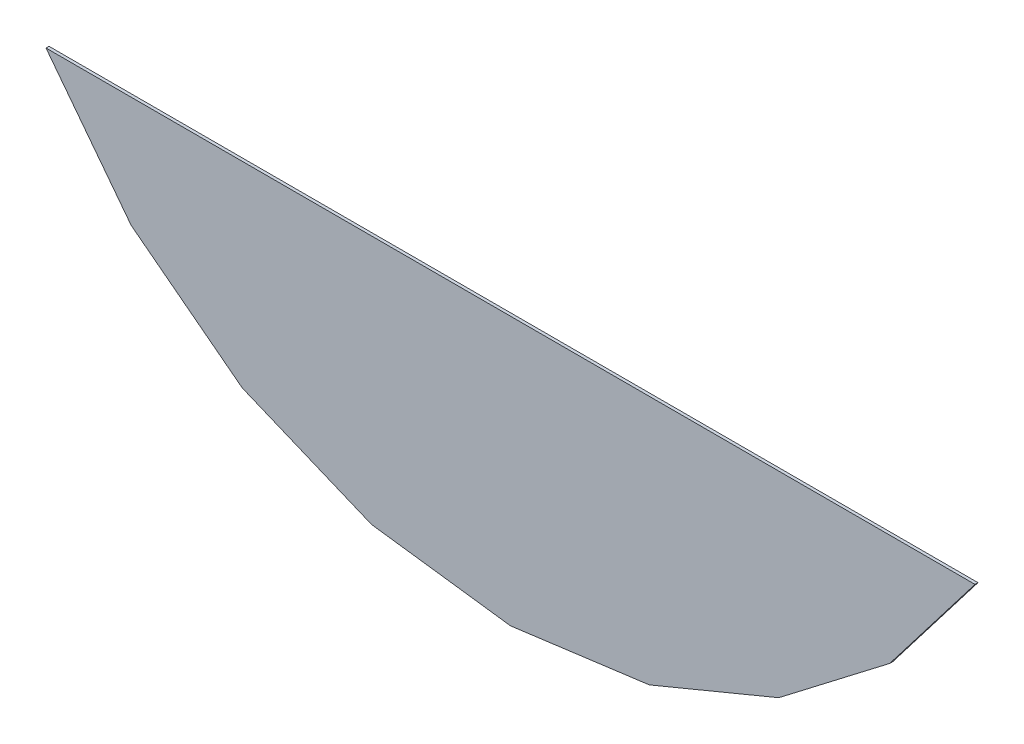
ISO-10303-21;
HEADER;
FILE_DESCRIPTION(('STEP AP214'),'2;1');
FILE_NAME('part.step','',(''),(''),'','','');
FILE_SCHEMA(('AUTOMOTIVE_DESIGN { 1 0 10303 214 1 1 1 1 }'));
ENDSEC;
DATA;
#1=APPLICATION_CONTEXT('core data for automotive mechanical design processes');
#2=APPLICATION_PROTOCOL_DEFINITION('international standard','automotive_design',2000,#1);
#3=PRODUCT_CONTEXT('',#1,'mechanical');
#4=PRODUCT('Part','Part','',(#3));
#5=PRODUCT_RELATED_PRODUCT_CATEGORY('part','',(#4));
#6=PRODUCT_DEFINITION_FORMATION('','',#4);
#7=PRODUCT_DEFINITION_CONTEXT('part definition',#1,'design');
#8=PRODUCT_DEFINITION('design','',#6,#7);
#9=PRODUCT_DEFINITION_SHAPE('','',#8);
#10=(LENGTH_UNIT() NAMED_UNIT(*) SI_UNIT(.MILLI.,.METRE.));
#11=(NAMED_UNIT(*) PLANE_ANGLE_UNIT() SI_UNIT($,.RADIAN.));
#12=(NAMED_UNIT(*) SI_UNIT($,.STERADIAN.) SOLID_ANGLE_UNIT());
#13=UNCERTAINTY_MEASURE_WITH_UNIT(LENGTH_MEASURE(1.E-05),#10,'distance_accuracy_value','');
#14=(GEOMETRIC_REPRESENTATION_CONTEXT(3) GLOBAL_UNCERTAINTY_ASSIGNED_CONTEXT((#13)) GLOBAL_UNIT_ASSIGNED_CONTEXT((#10,
#11,#12)) REPRESENTATION_CONTEXT('',''));
#15=CARTESIAN_POINT('',(0.,0.,0.));
#16=DIRECTION('',(0.,0.,1.));
#17=DIRECTION('',(1.,0.,0.));
#18=AXIS2_PLACEMENT_3D('',#15,#16,#17);
#19=CARTESIAN_POINT('',(-1.5588488,-2.74280376,3.9099998));
#20=DIRECTION('',(0.,0.,1.));
#21=DIRECTION('',(1.,0.,0.));
#22=AXIS2_PLACEMENT_3D('',#19,#20,#21);
#23=PLANE('',#22);
#24=DIRECTION('',(0.60876467009091,0.793350853310883,0.));
#25=VECTOR('',#24,1.);
#26=CARTESIAN_POINT('',(1.55884372,-2.74280376,3.9099998));
#27=LINE('',#26,#25);
#28=CARTESIAN_POINT('',(1.55884372,-2.74280376,3.9099998));
#29=VERTEX_POINT('',#28);
#30=CARTESIAN_POINT('',(1.27278891999998,-3.11559447999999,3.9099998));
#31=VERTEX_POINT('',#30);
#32=EDGE_CURVE('E126',#29,#31,#27,.F.);
#33=ORIENTED_EDGE('',*,*,#32,.F.);
#34=DIRECTION('',(1.,0.,0.));
#35=VECTOR('',#34,1.);
#36=CARTESIAN_POINT('',(-1.5588488,-2.74280376,3.9099998));
#37=LINE('',#36,#35);
#38=CARTESIAN_POINT('',(-1.55884880000003,-2.74280376000002,3.9099998));
#39=VERTEX_POINT('',#38);
#40=EDGE_CURVE('E99',#39,#29,#37,.T.);
#41=ORIENTED_EDGE('',*,*,#40,.F.);
#42=DIRECTION('',(0.60876467009091,-0.793350853310883,0.));
#43=VECTOR('',#42,1.);
#44=CARTESIAN_POINT('',(-1.272794,-3.11559448,3.9099998));
#45=LINE('',#44,#43);
#46=CARTESIAN_POINT('',(-1.27279399999999,-3.11559447999998,3.9099998));
#47=VERTEX_POINT('',#46);
#48=EDGE_CURVE('E19',#47,#39,#45,.F.);
#49=ORIENTED_EDGE('',*,*,#48,.F.);
#50=DIRECTION('',(0.793350853310883,-0.60876467009091,0.));
#51=VECTOR('',#50,1.);
#52=CARTESIAN_POINT('',(-0.90000328,-3.40164928,3.9099998));
#53=LINE('',#52,#51);
#54=CARTESIAN_POINT('',(-0.900003280000004,-3.40164928000001,3.9099998));
#55=VERTEX_POINT('',#54);
#56=EDGE_CURVE('E88',#55,#47,#53,.F.);
#57=ORIENTED_EDGE('',*,*,#56,.F.);
#58=DIRECTION('',(0.923880918501279,-0.382680086272115,0.));
#59=VECTOR('',#58,1.);
#60=CARTESIAN_POINT('',(-0.46587664,-3.58146858,3.9099998));
#61=LINE('',#60,#59);
#62=CARTESIAN_POINT('',(-0.465876640000006,-3.58146858000004,3.9099998));
#63=VERTEX_POINT('',#62);
#64=EDGE_CURVE('E83',#63,#55,#61,.F.);
#65=ORIENTED_EDGE('',*,*,#64,.F.);
#66=DIRECTION('',(0.991444891344749,-0.130525964567967,0.));
#67=VECTOR('',#66,1.);
#68=CARTESIAN_POINT('',(-2.539999996998E-06,-3.64280196,3.9099998));
#69=LINE('',#68,#67);
#70=CARTESIAN_POINT('',(-2.54000000317963E-06,-3.64280195999996,3.9099998));
#71=VERTEX_POINT('',#70);
#72=EDGE_CURVE('E110',#71,#63,#69,.F.);
#73=ORIENTED_EDGE('',*,*,#72,.F.);
#74=DIRECTION('',(0.991444891344749,0.130525964567967,0.));
#75=VECTOR('',#74,1.);
#76=CARTESIAN_POINT('',(0.46587156,-3.58146858,3.9099998));
#77=LINE('',#76,#75);
#78=CARTESIAN_POINT('',(0.465871559999998,-3.58146857999999,3.9099998));
#79=VERTEX_POINT('',#78);
#80=EDGE_CURVE('E114',#79,#71,#77,.F.);
#81=ORIENTED_EDGE('',*,*,#80,.F.);
#82=DIRECTION('',(0.923880918501279,0.382680086272115,0.));
#83=VECTOR('',#82,1.);
#84=CARTESIAN_POINT('',(0.8999982,-3.40164928,3.9099998));
#85=LINE('',#84,#83);
#86=CARTESIAN_POINT('',(0.899998200000011,-3.40164928000002,3.9099998));
#87=VERTEX_POINT('',#86);
#88=EDGE_CURVE('E118',#87,#79,#85,.F.);
#89=ORIENTED_EDGE('',*,*,#88,.F.);
#90=DIRECTION('',(0.793350853310883,0.60876467009091,0.));
#91=VECTOR('',#90,1.);
#92=CARTESIAN_POINT('',(1.27278892,-3.11559448,3.9099998));
#93=LINE('',#92,#91);
#94=EDGE_CURVE('E122',#31,#87,#93,.F.);
#95=ORIENTED_EDGE('',*,*,#94,.F.);
#96=EDGE_LOOP('',(#33,#41,#49,#57,#65,#73,#81,#89,#95));
#97=FACE_BOUND('',#96,.T.);
#98=ADVANCED_FACE('F16',(#97),#23,.T.);
#99=CARTESIAN_POINT('',(-1.272794,-3.11559448,3.89999982));
#100=DIRECTION('',(-0.793350853310883,-0.60876467009091,0.));
#101=DIRECTION('',(0.60876467009091,-0.793350853310883,0.));
#102=AXIS2_PLACEMENT_3D('',#99,#100,#101);
#103=PLANE('',#102);
#104=DIRECTION('',(0.,0.,1.));
#105=VECTOR('',#104,1.);
#106=CARTESIAN_POINT('',(-1.5588488,-2.74280376,3.89999982));
#107=LINE('',#106,#105);
#108=CARTESIAN_POINT('',(-1.55884880000003,-2.74280376000002,3.89999982));
#109=VERTEX_POINT('',#108);
#110=EDGE_CURVE('E130',#109,#39,#107,.T.);
#111=ORIENTED_EDGE('',*,*,#110,.F.);
#112=DIRECTION('',(0.608764670090777,-0.793350853310985,0.));
#113=VECTOR('',#112,1.);
#114=CARTESIAN_POINT('',(-1.5588488,-2.74280376,3.89999982));
#115=LINE('',#114,#113);
#116=CARTESIAN_POINT('',(-1.27279399999999,-3.11559447999998,3.89999982));
#117=VERTEX_POINT('',#116);
#118=EDGE_CURVE('E105',#109,#117,#115,.T.);
#119=ORIENTED_EDGE('',*,*,#118,.T.);
#120=DIRECTION('',(0.,0.,1.));
#121=VECTOR('',#120,1.);
#122=CARTESIAN_POINT('',(-1.27279399999995,-3.11559447999994,3.89999982));
#123=LINE('',#122,#121);
#124=EDGE_CURVE('E93',#47,#117,#123,.F.);
#125=ORIENTED_EDGE('',*,*,#124,.F.);
#126=ORIENTED_EDGE('',*,*,#48,.T.);
#127=EDGE_LOOP('',(#111,#119,#125,#126));
#128=FACE_BOUND('',#127,.T.);
#129=ADVANCED_FACE('F104',(#128),#103,.T.);
#130=CARTESIAN_POINT('',(-0.90000328,-3.40164928,3.89999982));
#131=DIRECTION('',(-0.60876467009091,-0.793350853310883,0.));
#132=DIRECTION('',(0.793350853310883,-0.60876467009091,0.));
#133=AXIS2_PLACEMENT_3D('',#130,#131,#132);
#134=PLANE('',#133);
#135=ORIENTED_EDGE('',*,*,#124,.T.);
#136=DIRECTION('',(0.793350853310985,-0.608764670090777,0.));
#137=VECTOR('',#136,1.);
#138=CARTESIAN_POINT('',(-1.272794,-3.11559448,3.89999982));
#139=LINE('',#138,#137);
#140=CARTESIAN_POINT('',(-0.900003280000004,-3.40164928000001,3.89999982));
#141=VERTEX_POINT('',#140);
#142=EDGE_CURVE('E135',#117,#141,#139,.T.);
#143=ORIENTED_EDGE('',*,*,#142,.T.);
#144=DIRECTION('',(0.,0.,1.));
#145=VECTOR('',#144,1.);
#146=CARTESIAN_POINT('',(-0.900003280000013,-3.40164928000003,3.89999982));
#147=LINE('',#146,#145);
#148=EDGE_CURVE('E95',#55,#141,#147,.F.);
#149=ORIENTED_EDGE('',*,*,#148,.F.);
#150=ORIENTED_EDGE('',*,*,#56,.T.);
#151=EDGE_LOOP('',(#135,#143,#149,#150));
#152=FACE_BOUND('',#151,.T.);
#153=ADVANCED_FACE('F90',(#152),#134,.T.);
#154=CARTESIAN_POINT('',(-0.46587664,-3.58146858,3.89999982));
#155=DIRECTION('',(-0.382680086272115,-0.923880918501279,0.));
#156=DIRECTION('',(0.923880918501279,-0.382680086272115,0.));
#157=AXIS2_PLACEMENT_3D('',#154,#155,#156);
#158=PLANE('',#157);
#159=ORIENTED_EDGE('',*,*,#148,.T.);
#160=DIRECTION('',(0.923880918501252,-0.382680086272181,0.));
#161=VECTOR('',#160,1.);
#162=CARTESIAN_POINT('',(-0.90000328,-3.40164928,3.89999982));
#163=LINE('',#162,#161);
#164=CARTESIAN_POINT('',(-0.465876640000006,-3.58146858000004,3.89999982));
#165=VERTEX_POINT('',#164);
#166=EDGE_CURVE('E137',#141,#165,#163,.T.);
#167=ORIENTED_EDGE('',*,*,#166,.T.);
#168=DIRECTION('',(0.,0.,1.));
#169=VECTOR('',#168,1.);
#170=CARTESIAN_POINT('',(-0.465876640000022,-3.58146858000017,3.89999982));
#171=LINE('',#170,#169);
#172=EDGE_CURVE('E112',#63,#165,#171,.F.);
#173=ORIENTED_EDGE('',*,*,#172,.F.);
#174=ORIENTED_EDGE('',*,*,#64,.T.);
#175=EDGE_LOOP('',(#159,#167,#173,#174));
#176=FACE_BOUND('',#175,.T.);
#177=ADVANCED_FACE('F179',(#176),#158,.T.);
#178=CARTESIAN_POINT('',(-2.539999996998E-06,-3.64280196,3.89999982));
#179=DIRECTION('',(-0.130525964567967,-0.991444891344749,0.));
#180=DIRECTION('',(0.991444891344749,-0.130525964567967,0.));
#181=AXIS2_PLACEMENT_3D('',#178,#179,#180);
#182=PLANE('',#181);
#183=ORIENTED_EDGE('',*,*,#172,.T.);
#184=DIRECTION('',(0.991444891344702,-0.13052596456833,0.));
#185=VECTOR('',#184,1.);
#186=CARTESIAN_POINT('',(-0.46587664,-3.58146858,3.89999982));
#187=LINE('',#186,#185);
#188=CARTESIAN_POINT('',(-2.54000000290879E-06,-3.64280195999996,3.89999982));
#189=VERTEX_POINT('',#188);
#190=EDGE_CURVE('E140',#165,#189,#187,.T.);
#191=ORIENTED_EDGE('',*,*,#190,.T.);
#192=DIRECTION('',(0.,0.,1.));
#193=VECTOR('',#192,1.);
#194=CARTESIAN_POINT('',(-2.5400000195578E-06,-3.64280195999983,3.89999982));
#195=LINE('',#194,#193);
#196=EDGE_CURVE('E116',#71,#189,#195,.F.);
#197=ORIENTED_EDGE('',*,*,#196,.F.);
#198=ORIENTED_EDGE('',*,*,#72,.T.);
#199=EDGE_LOOP('',(#183,#191,#197,#198));
#200=FACE_BOUND('',#199,.T.);
#201=ADVANCED_FACE('F177',(#200),#182,.T.);
#202=CARTESIAN_POINT('',(0.46587156,-3.58146858,3.89999982));
#203=DIRECTION('',(0.130525964567967,-0.991444891344749,0.));
#204=DIRECTION('',(0.991444891344749,0.130525964567967,0.));
#205=AXIS2_PLACEMENT_3D('',#202,#203,#204);
#206=PLANE('',#205);
#207=ORIENTED_EDGE('',*,*,#196,.T.);
#208=DIRECTION('',(0.991444891344701,0.130525964568331,0.));
#209=VECTOR('',#208,1.);
#210=CARTESIAN_POINT('',(-2.5399999970064E-06,-3.64280196,3.89999982));
#211=LINE('',#210,#209);
#212=CARTESIAN_POINT('',(0.465871559999997,-3.58146857999999,3.89999982));
#213=VERTEX_POINT('',#212);
#214=EDGE_CURVE('E143',#189,#213,#211,.T.);
#215=ORIENTED_EDGE('',*,*,#214,.T.);
#216=DIRECTION('',(0.,0.,1.));
#217=VECTOR('',#216,1.);
#218=CARTESIAN_POINT('',(0.465871559999987,-3.58146857999997,3.89999982));
#219=LINE('',#218,#217);
#220=EDGE_CURVE('E120',#79,#213,#219,.F.);
#221=ORIENTED_EDGE('',*,*,#220,.F.);
#222=ORIENTED_EDGE('',*,*,#80,.T.);
#223=EDGE_LOOP('',(#207,#215,#221,#222));
#224=FACE_BOUND('',#223,.T.);
#225=ADVANCED_FACE('F173',(#224),#206,.T.);
#226=CARTESIAN_POINT('',(0.8999982,-3.40164928,3.89999982));
#227=DIRECTION('',(0.382680086272115,-0.923880918501279,0.));
#228=DIRECTION('',(0.923880918501279,0.382680086272115,0.));
#229=AXIS2_PLACEMENT_3D('',#226,#227,#228);
#230=PLANE('',#229);
#231=ORIENTED_EDGE('',*,*,#220,.T.);
#232=DIRECTION('',(0.923880918501251,0.382680086272181,0.));
#233=VECTOR('',#232,1.);
#234=CARTESIAN_POINT('',(0.46587156,-3.58146858,3.89999982));
#235=LINE('',#234,#233);
#236=CARTESIAN_POINT('',(0.899998200000012,-3.40164928000002,3.89999982));
#237=VERTEX_POINT('',#236);
#238=EDGE_CURVE('E146',#213,#237,#235,.T.);
#239=ORIENTED_EDGE('',*,*,#238,.T.);
#240=DIRECTION('',(0.,0.,1.));
#241=VECTOR('',#240,1.);
#242=CARTESIAN_POINT('',(0.899998200000048,-3.40164928000006,3.89999982));
#243=LINE('',#242,#241);
#244=EDGE_CURVE('E124',#87,#237,#243,.F.);
#245=ORIENTED_EDGE('',*,*,#244,.F.);
#246=ORIENTED_EDGE('',*,*,#88,.T.);
#247=EDGE_LOOP('',(#231,#239,#245,#246));
#248=FACE_BOUND('',#247,.T.);
#249=ADVANCED_FACE('F167',(#248),#230,.T.);
#250=CARTESIAN_POINT('',(1.27278892,-3.11559448,3.89999982));
#251=DIRECTION('',(0.60876467009091,-0.793350853310883,0.));
#252=DIRECTION('',(0.793350853310883,0.60876467009091,0.));
#253=AXIS2_PLACEMENT_3D('',#250,#251,#252);
#254=PLANE('',#253);
#255=ORIENTED_EDGE('',*,*,#244,.T.);
#256=DIRECTION('',(0.793350853310985,0.608764670090777,0.));
#257=VECTOR('',#256,1.);
#258=CARTESIAN_POINT('',(0.8999982,-3.40164928,3.89999982));
#259=LINE('',#258,#257);
#260=CARTESIAN_POINT('',(1.27278891999998,-3.11559447999999,3.89999982));
#261=VERTEX_POINT('',#260);
#262=EDGE_CURVE('E149',#237,#261,#259,.T.);
#263=ORIENTED_EDGE('',*,*,#262,.T.);
#264=DIRECTION('',(0.,0.,1.));
#265=VECTOR('',#264,1.);
#266=CARTESIAN_POINT('',(1.27278891999994,-3.11559447999995,3.89999982));
#267=LINE('',#266,#265);
#268=EDGE_CURVE('E128',#31,#261,#267,.F.);
#269=ORIENTED_EDGE('',*,*,#268,.F.);
#270=ORIENTED_EDGE('',*,*,#94,.T.);
#271=EDGE_LOOP('',(#255,#263,#269,#270));
#272=FACE_BOUND('',#271,.T.);
#273=ADVANCED_FACE('F162',(#272),#254,.T.);
#274=CARTESIAN_POINT('',(1.55884372,-2.74280376,3.89999982));
#275=DIRECTION('',(0.793350853310883,-0.60876467009091,0.));
#276=DIRECTION('',(0.60876467009091,0.793350853310883,0.));
#277=AXIS2_PLACEMENT_3D('',#274,#275,#276);
#278=PLANE('',#277);
#279=ORIENTED_EDGE('',*,*,#268,.T.);
#280=DIRECTION('',(0.608764670090777,0.793350853310985,0.));
#281=VECTOR('',#280,1.);
#282=CARTESIAN_POINT('',(1.27278892,-3.11559448,3.89999982));
#283=LINE('',#282,#281);
#284=CARTESIAN_POINT('',(1.55884372,-2.74280376,3.89999982));
#285=VERTEX_POINT('',#284);
#286=EDGE_CURVE('E25',#261,#285,#283,.T.);
#287=ORIENTED_EDGE('',*,*,#286,.T.);
#288=DIRECTION('',(0.,0.,1.));
#289=VECTOR('',#288,1.);
#290=CARTESIAN_POINT('',(1.55884372,-2.74280376,3.89999982));
#291=LINE('',#290,#289);
#292=EDGE_CURVE('E33',#29,#285,#291,.F.);
#293=ORIENTED_EDGE('',*,*,#292,.F.);
#294=ORIENTED_EDGE('',*,*,#32,.T.);
#295=EDGE_LOOP('',(#279,#287,#293,#294));
#296=FACE_BOUND('',#295,.T.);
#297=ADVANCED_FACE('F155',(#296),#278,.T.);
#298=CARTESIAN_POINT('',(-1.5588488,-2.74280376,3.89999982));
#299=DIRECTION('',(0.,1.,0.));
#300=DIRECTION('',(0.,0.,1.));
#301=AXIS2_PLACEMENT_3D('',#298,#299,#300);
#302=PLANE('',#301);
#303=ORIENTED_EDGE('',*,*,#292,.T.);
#304=DIRECTION('',(1.,0.,0.));
#305=VECTOR('',#304,1.);
#306=CARTESIAN_POINT('',(-1.5588488,-2.74280376,3.89999982));
#307=LINE('',#306,#305);
#308=EDGE_CURVE('E11',#285,#109,#307,.F.);
#309=ORIENTED_EDGE('',*,*,#308,.T.);
#310=ORIENTED_EDGE('',*,*,#110,.T.);
#311=ORIENTED_EDGE('',*,*,#40,.T.);
#312=EDGE_LOOP('',(#303,#309,#310,#311));
#313=FACE_BOUND('',#312,.T.);
#314=ADVANCED_FACE('F190',(#313),#302,.T.);
#315=CARTESIAN_POINT('',(-1.5588488,-2.74280376,3.89999982));
#316=DIRECTION('',(0.,0.,1.));
#317=DIRECTION('',(1.,0.,0.));
#318=AXIS2_PLACEMENT_3D('',#315,#316,#317);
#319=PLANE('',#318);
#320=ORIENTED_EDGE('',*,*,#286,.F.);
#321=ORIENTED_EDGE('',*,*,#262,.F.);
#322=ORIENTED_EDGE('',*,*,#238,.F.);
#323=ORIENTED_EDGE('',*,*,#214,.F.);
#324=ORIENTED_EDGE('',*,*,#190,.F.);
#325=ORIENTED_EDGE('',*,*,#166,.F.);
#326=ORIENTED_EDGE('',*,*,#142,.F.);
#327=ORIENTED_EDGE('',*,*,#118,.F.);
#328=ORIENTED_EDGE('',*,*,#308,.F.);
#329=EDGE_LOOP('',(#320,#321,#322,#323,#324,#325,#326,#327,#328));
#330=FACE_BOUND('',#329,.T.);
#331=ADVANCED_FACE('F159',(#330),#319,.F.);
#332=CLOSED_SHELL('',(#98,#129,#153,#177,#201,#225,#249,#273,#297,#314,#331));
#333=MANIFOLD_SOLID_BREP('B1',#332);
#334=ADVANCED_BREP_SHAPE_REPRESENTATION('',(#18,#333),#14);
#335=SHAPE_DEFINITION_REPRESENTATION(#9,#334);
ENDSEC;
END-ISO-10303-21;
